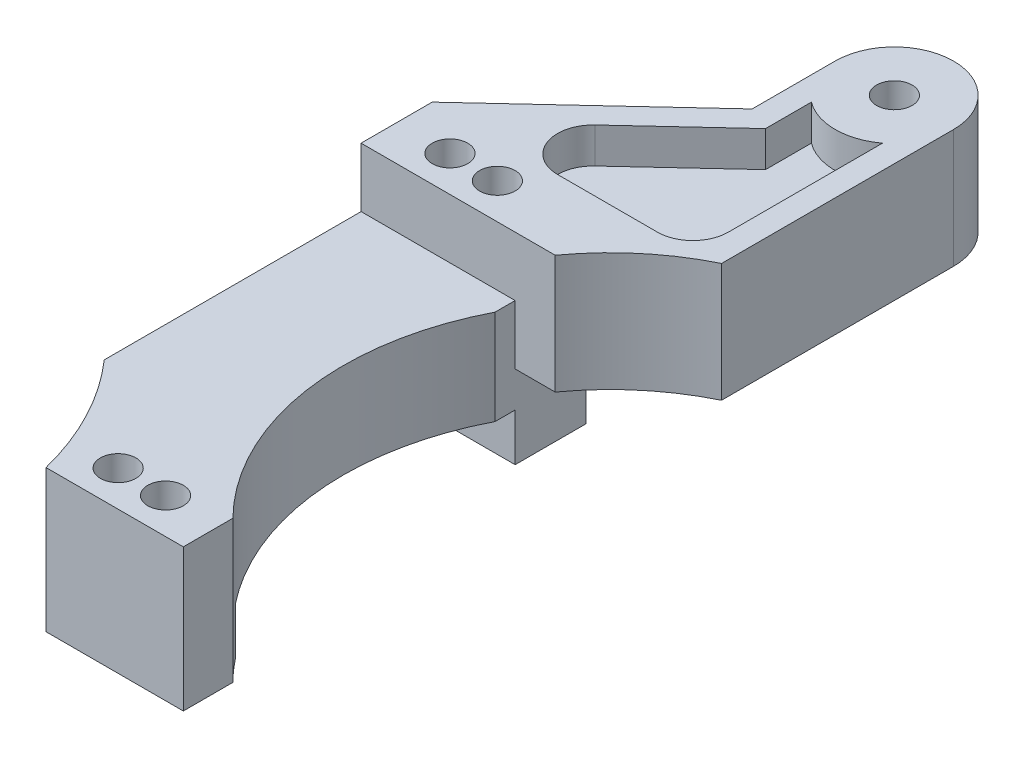
ISO-10303-21;
HEADER;
FILE_DESCRIPTION(('STEP AP214'),'2;1');
FILE_NAME('part.step','',(''),(''),'','','');
FILE_SCHEMA(('AUTOMOTIVE_DESIGN { 1 0 10303 214 1 1 1 1 }'));
ENDSEC;
DATA;
#1=APPLICATION_CONTEXT('core data for automotive mechanical design processes');
#2=APPLICATION_PROTOCOL_DEFINITION('international standard','automotive_design',2000,#1);
#3=PRODUCT_CONTEXT('',#1,'mechanical');
#4=PRODUCT('Part','Part','',(#3));
#5=PRODUCT_RELATED_PRODUCT_CATEGORY('part','',(#4));
#6=PRODUCT_DEFINITION_FORMATION('','',#4);
#7=PRODUCT_DEFINITION_CONTEXT('part definition',#1,'design');
#8=PRODUCT_DEFINITION('design','',#6,#7);
#9=PRODUCT_DEFINITION_SHAPE('','',#8);
#10=(LENGTH_UNIT() NAMED_UNIT(*) SI_UNIT(.MILLI.,.METRE.));
#11=(NAMED_UNIT(*) PLANE_ANGLE_UNIT() SI_UNIT($,.RADIAN.));
#12=(NAMED_UNIT(*) SI_UNIT($,.STERADIAN.) SOLID_ANGLE_UNIT());
#13=UNCERTAINTY_MEASURE_WITH_UNIT(LENGTH_MEASURE(1.E-05),#10,'distance_accuracy_value','');
#14=(GEOMETRIC_REPRESENTATION_CONTEXT(3) GLOBAL_UNCERTAINTY_ASSIGNED_CONTEXT((#13)) GLOBAL_UNIT_ASSIGNED_CONTEXT((#10,
#11,#12)) REPRESENTATION_CONTEXT('',''));
#15=CARTESIAN_POINT('',(0.,0.,0.));
#16=DIRECTION('',(0.,0.,1.));
#17=DIRECTION('',(1.,0.,0.));
#18=AXIS2_PLACEMENT_3D('',#15,#16,#17);
#19=CARTESIAN_POINT('',(0.,8.,0.));
#20=DIRECTION('',(0.,1.,0.));
#21=DIRECTION('',(0.,0.,1.));
#22=AXIS2_PLACEMENT_3D('',#19,#20,#21);
#23=PLANE('',#22);
#24=CARTESIAN_POINT('',(51.6000000000015,8.,-25.9999999999971));
#25=DIRECTION('',(0.,1.,0.));
#26=DIRECTION('',(0.,0.,1.));
#27=AXIS2_PLACEMENT_3D('',#24,#25,#26);
#28=CIRCLE('',#27,20.5);
#29=CARTESIAN_POINT('',(42.6000000000031,8.,-44.4187404563917));
#30=VERTEX_POINT('',#29);
#31=CARTESIAN_POINT('',(34.9792298614077,8.,-37.9999999999983));
#32=VERTEX_POINT('',#31);
#33=EDGE_CURVE('E307',#30,#32,#28,.T.);
#34=ORIENTED_EDGE('',*,*,#33,.F.);
#35=DIRECTION('',(0.,0.,-1.));
#36=VECTOR('',#35,1.);
#37=CARTESIAN_POINT('',(42.6000000000031,8.,0.));
#38=LINE('',#37,#36);
#39=CARTESIAN_POINT('',(42.6000000000031,8.,-63.9999999999983));
#40=VERTEX_POINT('',#39);
#41=EDGE_CURVE('E316',#30,#40,#38,.T.);
#42=ORIENTED_EDGE('',*,*,#41,.T.);
#43=CARTESIAN_POINT('',(37.6000000000031,8.,-63.9999999999983));
#44=DIRECTION('',(0.,1.,0.));
#45=DIRECTION('',(0.,0.,1.));
#46=AXIS2_PLACEMENT_3D('',#43,#44,#45);
#47=CIRCLE('',#46,5.);
#48=CARTESIAN_POINT('',(32.6000000000031,8.,-63.9999999999983));
#49=VERTEX_POINT('',#48);
#50=EDGE_CURVE('E325',#49,#40,#47,.F.);
#51=ORIENTED_EDGE('',*,*,#50,.F.);
#52=DIRECTION('',(0.,0.,-1.));
#53=VECTOR('',#52,1.);
#54=CARTESIAN_POINT('',(32.6000000000031,8.,0.));
#55=LINE('',#54,#53);
#56=CARTESIAN_POINT('',(32.6000000000031,8.,-56.9999999999982));
#57=VERTEX_POINT('',#56);
#58=EDGE_CURVE('E327',#57,#49,#55,.T.);
#59=ORIENTED_EDGE('',*,*,#58,.F.);
#60=DIRECTION('',(-0.732793491626299,0.,0.680451099367278));
#61=VECTOR('',#60,1.);
#62=CARTESIAN_POINT('',(-13.3276712328744,8.,-14.3528767123262));
#63=LINE('',#62,#61);
#64=CARTESIAN_POINT('',(18.6000000000031,8.,-43.9999999999983));
#65=VERTEX_POINT('',#64);
#66=EDGE_CURVE('E348',#57,#65,#63,.T.);
#67=ORIENTED_EDGE('',*,*,#66,.T.);
#68=DIRECTION('',(0.,0.,1.));
#69=VECTOR('',#68,1.);
#70=CARTESIAN_POINT('',(18.6000000000031,8.,0.));
#71=LINE('',#70,#69);
#72=CARTESIAN_POINT('',(18.6000000000031,8.,-37.9999999999983));
#73=VERTEX_POINT('',#72);
#74=EDGE_CURVE('E329',#65,#73,#71,.T.);
#75=ORIENTED_EDGE('',*,*,#74,.T.);
#76=DIRECTION('',(1.,0.,0.));
#77=VECTOR('',#76,1.);
#78=CARTESIAN_POINT('',(0.,8.,-37.9999999999983));
#79=LINE('',#78,#77);
#80=EDGE_CURVE('E319',#73,#32,#79,.T.);
#81=ORIENTED_EDGE('',*,*,#80,.T.);
#82=EDGE_LOOP('',(#34,#42,#51,#59,#67,#75,#81));
#83=FACE_BOUND('',#82,.T.);
#84=CARTESIAN_POINT('',(37.6000000000031,8.,-63.9999999999983));
#85=DIRECTION('',(0.,1.,0.));
#86=DIRECTION('',(0.,0.,1.));
#87=AXIS2_PLACEMENT_3D('',#84,#85,#86);
#88=CIRCLE('',#87,1.5);
#89=CARTESIAN_POINT('',(37.6000000000031,8.,-62.4999999999983));
#90=VERTEX_POINT('',#89);
#91=EDGE_CURVE('E335',#90,#90,#88,.F.);
#92=ORIENTED_EDGE('',*,*,#91,.T.);
#93=EDGE_LOOP('',(#92));
#94=FACE_BOUND('',#93,.T.);
#95=CARTESIAN_POINT('',(23.1000000000031,8.,-40.9999999999982));
#96=DIRECTION('',(0.,1.,0.));
#97=DIRECTION('',(0.,0.,1.));
#98=AXIS2_PLACEMENT_3D('',#95,#96,#97);
#99=CIRCLE('',#98,1.50000000000001);
#100=CARTESIAN_POINT('',(23.1000000000031,8.,-39.4999999999982));
#101=VERTEX_POINT('',#100);
#102=EDGE_CURVE('E338',#101,#101,#99,.F.);
#103=ORIENTED_EDGE('',*,*,#102,.T.);
#104=EDGE_LOOP('',(#103));
#105=FACE_BOUND('',#104,.T.);
#106=CARTESIAN_POINT('',(27.1000000000031,8.,-40.9999999999979));
#107=DIRECTION('',(0.,1.,0.));
#108=DIRECTION('',(0.,0.,1.));
#109=AXIS2_PLACEMENT_3D('',#106,#107,#108);
#110=CIRCLE('',#109,1.5);
#111=CARTESIAN_POINT('',(27.1000000000031,8.,-39.4999999999979));
#112=VERTEX_POINT('',#111);
#113=EDGE_CURVE('E341',#112,#112,#110,.F.);
#114=ORIENTED_EDGE('',*,*,#113,.T.);
#115=EDGE_LOOP('',(#114));
#116=FACE_BOUND('',#115,.T.);
#117=DIRECTION('',(0.,0.,1.));
#118=VECTOR('',#117,1.);
#119=CARTESIAN_POINT('',(34.6000000000032,8.,0.));
#120=LINE('',#119,#118);
#121=CARTESIAN_POINT('',(34.6000000000031,8.,-59.9999999999983));
#122=VERTEX_POINT('',#121);
#123=CARTESIAN_POINT('',(34.6000000000031,8.,-56.1278609750636));
#124=VERTEX_POINT('',#123);
#125=EDGE_CURVE('E521',#122,#124,#120,.T.);
#126=ORIENTED_EDGE('',*,*,#125,.F.);
#127=CARTESIAN_POINT('',(37.6000000000031,8.,-63.9999999999983));
#128=DIRECTION('',(0.,1.,0.));
#129=DIRECTION('',(0.,0.,1.));
#130=AXIS2_PLACEMENT_3D('',#127,#128,#129);
#131=CIRCLE('',#130,5.00000000000001);
#132=CARTESIAN_POINT('',(40.6000000000031,8.,-59.9999999999983));
#133=VERTEX_POINT('',#132);
#134=EDGE_CURVE('E519',#122,#133,#131,.T.);
#135=ORIENTED_EDGE('',*,*,#134,.T.);
#136=DIRECTION('',(0.,0.,-1.));
#137=VECTOR('',#136,1.);
#138=CARTESIAN_POINT('',(40.6000000000031,8.,0.));
#139=LINE('',#138,#137);
#140=CARTESIAN_POINT('',(40.6000000000031,8.,-46.9999999999983));
#141=VERTEX_POINT('',#140);
#142=EDGE_CURVE('E488',#141,#133,#139,.T.);
#143=ORIENTED_EDGE('',*,*,#142,.F.);
#144=CARTESIAN_POINT('',(37.6000000000031,8.,-46.9999999999983));
#145=DIRECTION('',(0.,1.,0.));
#146=DIRECTION('',(0.,0.,1.));
#147=AXIS2_PLACEMENT_3D('',#144,#145,#146);
#148=CIRCLE('',#147,3.);
#149=CARTESIAN_POINT('',(37.6000000000031,8.,-43.9999999999983));
#150=VERTEX_POINT('',#149);
#151=EDGE_CURVE('E139',#141,#150,#148,.F.);
#152=ORIENTED_EDGE('',*,*,#151,.T.);
#153=DIRECTION('',(1.,0.,0.));
#154=VECTOR('',#153,1.);
#155=CARTESIAN_POINT('',(0.,8.,-43.9999999999983));
#156=LINE('',#155,#154);
#157=CARTESIAN_POINT('',(29.1788358363657,8.,-43.9999999999983));
#158=VERTEX_POINT('',#157);
#159=EDGE_CURVE('E486',#158,#150,#156,.T.);
#160=ORIENTED_EDGE('',*,*,#159,.F.);
#161=CARTESIAN_POINT('',(29.1788358363657,8.,-46.9999999999983));
#162=DIRECTION('',(0.,1.,0.));
#163=DIRECTION('',(0.,0.,1.));
#164=AXIS2_PLACEMENT_3D('',#161,#162,#163);
#165=CIRCLE('',#164,3.);
#166=CARTESIAN_POINT('',(27.1374825382639,8.,-49.1983804748771));
#167=VERTEX_POINT('',#166);
#168=EDGE_CURVE('E480',#158,#167,#165,.F.);
#169=ORIENTED_EDGE('',*,*,#168,.T.);
#170=DIRECTION('',(-0.732793491626299,0.,0.680451099367278));
#171=VECTOR('',#170,1.);
#172=CARTESIAN_POINT('',(-11.9667690341398,8.,-12.8872897290736));
#173=LINE('',#172,#171);
#174=EDGE_CURVE('E494',#124,#167,#173,.T.);
#175=ORIENTED_EDGE('',*,*,#174,.F.);
#176=EDGE_LOOP('',(#126,#135,#143,#152,#160,#169,#175));
#177=FACE_BOUND('',#176,.T.);
#178=ADVANCED_FACE('F131',(#83,#94,#105,#116,#177),#23,.T.);
#179=CARTESIAN_POINT('',(0.,-5.,-43.9999999999983));
#180=DIRECTION('',(0.,0.,-1.));
#181=DIRECTION('',(0.,1.,0.));
#182=AXIS2_PLACEMENT_3D('',#179,#180,#181);
#183=PLANE('',#182);
#184=DIRECTION('',(0.,-1.,0.));
#185=VECTOR('',#184,1.);
#186=CARTESIAN_POINT('',(18.6000000000031,-5.,-43.9999999999983));
#187=LINE('',#186,#185);
#188=CARTESIAN_POINT('',(18.6000000000031,-2.,-43.9999999999983));
#189=VERTEX_POINT('',#188);
#190=CARTESIAN_POINT('',(18.6000000000031,-9.,-43.9999999999983));
#191=VERTEX_POINT('',#190);
#192=EDGE_CURVE('E461',#189,#191,#187,.T.);
#193=ORIENTED_EDGE('',*,*,#192,.F.);
#194=DIRECTION('',(-1.,0.,0.));
#195=VECTOR('',#194,1.);
#196=CARTESIAN_POINT('',(0.,-2.,-43.9999999999983));
#197=LINE('',#196,#195);
#198=CARTESIAN_POINT('',(31.6000000000031,-2.,-43.9999999999983));
#199=VERTEX_POINT('',#198);
#200=EDGE_CURVE('E539',#199,#189,#197,.T.);
#201=ORIENTED_EDGE('',*,*,#200,.F.);
#202=DIRECTION('',(0.,-1.,0.));
#203=VECTOR('',#202,1.);
#204=CARTESIAN_POINT('',(31.6000000000031,-5.,-43.9999999999983));
#205=LINE('',#204,#203);
#206=CARTESIAN_POINT('',(31.6000000000031,-9.,-43.9999999999983));
#207=VERTEX_POINT('',#206);
#208=EDGE_CURVE('E465',#199,#207,#205,.T.);
#209=ORIENTED_EDGE('',*,*,#208,.T.);
#210=DIRECTION('',(1.,0.,0.));
#211=VECTOR('',#210,1.);
#212=CARTESIAN_POINT('',(0.,-9.,-43.9999999999983));
#213=LINE('',#212,#211);
#214=EDGE_CURVE('E449',#191,#207,#213,.T.);
#215=ORIENTED_EDGE('',*,*,#214,.F.);
#216=EDGE_LOOP('',(#193,#201,#209,#215));
#217=FACE_BOUND('',#216,.T.);
#218=ADVANCED_FACE('F600',(#217),#183,.T.);
#219=CARTESIAN_POINT('',(31.6000000000031,-5.,0.));
#220=DIRECTION('',(1.,0.,0.));
#221=DIRECTION('',(0.,1.,0.));
#222=AXIS2_PLACEMENT_3D('',#219,#220,#221);
#223=PLANE('',#222);
#224=DIRECTION('',(0.,1.,0.));
#225=VECTOR('',#224,1.);
#226=CARTESIAN_POINT('',(31.6000000000031,-2.,-37.9999999999983));
#227=LINE('',#226,#225);
#228=CARTESIAN_POINT('',(31.6000000000031,-2.,-37.9999999999982));
#229=VERTEX_POINT('',#228);
#230=CARTESIAN_POINT('',(31.6000000000031,3.,-37.9999999999983));
#231=VERTEX_POINT('',#230);
#232=EDGE_CURVE('E349',#229,#231,#227,.T.);
#233=ORIENTED_EDGE('',*,*,#232,.T.);
#234=DIRECTION('',(0.,0.,-1.));
#235=VECTOR('',#234,1.);
#236=CARTESIAN_POINT('',(31.6000000000031,3.,0.));
#237=LINE('',#236,#235);
#238=CARTESIAN_POINT('',(31.6000000000031,3.,-36.3077640640445));
#239=VERTEX_POINT('',#238);
#240=EDGE_CURVE('E407',#239,#231,#237,.T.);
#241=ORIENTED_EDGE('',*,*,#240,.F.);
#242=DIRECTION('',(0.,-1.,0.));
#243=VECTOR('',#242,1.);
#244=CARTESIAN_POINT('',(31.6000000000031,3.,-36.3077640640445));
#245=LINE('',#244,#243);
#246=CARTESIAN_POINT('',(31.6000000000031,-5.,-36.3077640640445));
#247=VERTEX_POINT('',#246);
#248=EDGE_CURVE('E430',#239,#247,#245,.T.);
#249=ORIENTED_EDGE('',*,*,#248,.T.);
#250=DIRECTION('',(0.,0.,-1.));
#251=VECTOR('',#250,1.);
#252=CARTESIAN_POINT('',(31.6000000000031,-5.,0.));
#253=LINE('',#252,#251);
#254=CARTESIAN_POINT('',(31.6000000000031,-5.,-37.9999999999983));
#255=VERTEX_POINT('',#254);
#256=EDGE_CURVE('E420',#247,#255,#253,.T.);
#257=ORIENTED_EDGE('',*,*,#256,.T.);
#258=DIRECTION('',(0.,-1.,0.));
#259=VECTOR('',#258,1.);
#260=CARTESIAN_POINT('',(31.6000000000031,-5.,-37.9999999999983));
#261=LINE('',#260,#259);
#262=CARTESIAN_POINT('',(31.6000000000031,-9.,-37.9999999999983));
#263=VERTEX_POINT('',#262);
#264=EDGE_CURVE('E439',#255,#263,#261,.T.);
#265=ORIENTED_EDGE('',*,*,#264,.T.);
#266=DIRECTION('',(0.,0.,1.));
#267=VECTOR('',#266,1.);
#268=CARTESIAN_POINT('',(31.6000000000031,-9.,0.));
#269=LINE('',#268,#267);
#270=EDGE_CURVE('E446',#207,#263,#269,.T.);
#271=ORIENTED_EDGE('',*,*,#270,.F.);
#272=ORIENTED_EDGE('',*,*,#208,.F.);
#273=DIRECTION('',(0.,0.,-1.));
#274=VECTOR('',#273,1.);
#275=CARTESIAN_POINT('',(31.6000000000031,-2.,0.));
#276=LINE('',#275,#274);
#277=EDGE_CURVE('E542',#229,#199,#276,.T.);
#278=ORIENTED_EDGE('',*,*,#277,.F.);
#279=EDGE_LOOP('',(#233,#241,#249,#257,#265,#271,#272,#278));
#280=FACE_BOUND('',#279,.T.);
#281=ADVANCED_FACE('F607',(#280),#223,.T.);
#282=CARTESIAN_POINT('',(18.6000000000032,-5.,0.));
#283=DIRECTION('',(1.,0.,0.));
#284=DIRECTION('',(0.,0.,-1.));
#285=AXIS2_PLACEMENT_3D('',#282,#283,#284);
#286=PLANE('',#285);
#287=DIRECTION('',(0.,-1.,0.));
#288=VECTOR('',#287,1.);
#289=CARTESIAN_POINT('',(18.6000000000031,-5.,-37.9999999999983));
#290=LINE('',#289,#288);
#291=CARTESIAN_POINT('',(18.6000000000031,-5.,-37.9999999999983));
#292=VERTEX_POINT('',#291);
#293=CARTESIAN_POINT('',(18.6000000000031,-9.,-37.9999999999983));
#294=VERTEX_POINT('',#293);
#295=EDGE_CURVE('E458',#292,#294,#290,.T.);
#296=ORIENTED_EDGE('',*,*,#295,.F.);
#297=DIRECTION('',(0.,0.,-1.));
#298=VECTOR('',#297,1.);
#299=CARTESIAN_POINT('',(18.6000000000031,-5.,0.));
#300=LINE('',#299,#298);
#301=CARTESIAN_POINT('',(18.6000000000031,-5.,-16.3279668054502));
#302=VERTEX_POINT('',#301);
#303=EDGE_CURVE('E418',#302,#292,#300,.T.);
#304=ORIENTED_EDGE('',*,*,#303,.F.);
#305=DIRECTION('',(0.,-1.,0.));
#306=VECTOR('',#305,1.);
#307=CARTESIAN_POINT('',(18.6000000000031,3.,-16.3279668054502));
#308=LINE('',#307,#306);
#309=CARTESIAN_POINT('',(18.6000000000031,3.,-16.3279668054502));
#310=VERTEX_POINT('',#309);
#311=EDGE_CURVE('E432',#310,#302,#308,.T.);
#312=ORIENTED_EDGE('',*,*,#311,.F.);
#313=DIRECTION('',(0.,0.,-1.));
#314=VECTOR('',#313,1.);
#315=CARTESIAN_POINT('',(18.6000000000031,3.,0.));
#316=LINE('',#315,#314);
#317=CARTESIAN_POINT('',(18.6000000000031,3.,-37.9999999999982));
#318=VERTEX_POINT('',#317);
#319=EDGE_CURVE('E405',#310,#318,#316,.T.);
#320=ORIENTED_EDGE('',*,*,#319,.T.);
#321=DIRECTION('',(0.,-1.,0.));
#322=VECTOR('',#321,1.);
#323=CARTESIAN_POINT('',(18.6000000000031,8.,-37.9999999999983));
#324=LINE('',#323,#322);
#325=EDGE_CURVE('E354',#73,#318,#324,.T.);
#326=ORIENTED_EDGE('',*,*,#325,.F.);
#327=ORIENTED_EDGE('',*,*,#74,.F.);
#328=EDGE_CURVE('E462',#65,#189,#187,.T.);
#329=ORIENTED_EDGE('',*,*,#328,.T.);
#330=ORIENTED_EDGE('',*,*,#192,.T.);
#331=DIRECTION('',(0.,0.,1.));
#332=VECTOR('',#331,1.);
#333=CARTESIAN_POINT('',(18.6000000000032,-9.,0.));
#334=LINE('',#333,#332);
#335=EDGE_CURVE('E452',#191,#294,#334,.T.);
#336=ORIENTED_EDGE('',*,*,#335,.T.);
#337=EDGE_LOOP('',(#296,#304,#312,#320,#326,#327,#329,#330,#336));
#338=FACE_BOUND('',#337,.T.);
#339=ADVANCED_FACE('F561',(#338),#286,.F.);
#340=CARTESIAN_POINT('',(23.1000000000031,-5.,-40.9999999999982));
#341=DIRECTION('',(0.,-1.,0.));
#342=DIRECTION('',(0.,0.,-1.));
#343=AXIS2_PLACEMENT_3D('',#340,#341,#342);
#344=CYLINDRICAL_SURFACE('',#343,1.50000000000001);
#345=CARTESIAN_POINT('',(23.1000000000031,-9.,-40.9999999999982));
#346=DIRECTION('',(0.,1.,0.));
#347=DIRECTION('',(0.,0.,1.));
#348=AXIS2_PLACEMENT_3D('',#345,#346,#347);
#349=CIRCLE('',#348,1.50000000000001);
#350=CARTESIAN_POINT('',(23.1000000000031,-9.,-39.4999999999982));
#351=VERTEX_POINT('',#350);
#352=EDGE_CURVE('E443',#351,#351,#349,.T.);
#353=ORIENTED_EDGE('',*,*,#352,.F.);
#354=EDGE_LOOP('',(#353));
#355=FACE_BOUND('',#354,.T.);
#356=ORIENTED_EDGE('',*,*,#102,.F.);
#357=EDGE_LOOP('',(#356));
#358=FACE_BOUND('',#357,.T.);
#359=ADVANCED_FACE('F683',(#355,#358),#344,.F.);
#360=CARTESIAN_POINT('',(27.1000000000031,-5.,-40.9999999999979));
#361=DIRECTION('',(0.,-1.,0.));
#362=DIRECTION('',(0.,0.,-1.));
#363=AXIS2_PLACEMENT_3D('',#360,#361,#362);
#364=CYLINDRICAL_SURFACE('',#363,1.5);
#365=CARTESIAN_POINT('',(27.1000000000031,-9.,-40.9999999999979));
#366=DIRECTION('',(0.,1.,0.));
#367=DIRECTION('',(0.,0.,1.));
#368=AXIS2_PLACEMENT_3D('',#365,#366,#367);
#369=CIRCLE('',#368,1.5);
#370=CARTESIAN_POINT('',(27.1000000000031,-9.,-39.4999999999979));
#371=VERTEX_POINT('',#370);
#372=EDGE_CURVE('E427',#371,#371,#369,.T.);
#373=ORIENTED_EDGE('',*,*,#372,.F.);
#374=EDGE_LOOP('',(#373));
#375=FACE_BOUND('',#374,.T.);
#376=ORIENTED_EDGE('',*,*,#113,.F.);
#377=EDGE_LOOP('',(#376));
#378=FACE_BOUND('',#377,.T.);
#379=ADVANCED_FACE('F681',(#375,#378),#364,.F.);
#380=CARTESIAN_POINT('',(0.,-5.,-37.9999999999983));
#381=DIRECTION('',(0.,0.,-1.));
#382=DIRECTION('',(0.,1.,0.));
#383=AXIS2_PLACEMENT_3D('',#380,#381,#382);
#384=PLANE('',#383);
#385=DIRECTION('',(1.,0.,0.));
#386=VECTOR('',#385,1.);
#387=CARTESIAN_POINT('',(0.,-9.,-37.9999999999983));
#388=LINE('',#387,#386);
#389=EDGE_CURVE('E440',#294,#263,#388,.T.);
#390=ORIENTED_EDGE('',*,*,#389,.T.);
#391=ORIENTED_EDGE('',*,*,#264,.F.);
#392=DIRECTION('',(1.,0.,0.));
#393=VECTOR('',#392,1.);
#394=CARTESIAN_POINT('',(0.,-5.,-37.9999999999983));
#395=LINE('',#394,#393);
#396=EDGE_CURVE('E436',#292,#255,#395,.T.);
#397=ORIENTED_EDGE('',*,*,#396,.F.);
#398=ORIENTED_EDGE('',*,*,#295,.T.);
#399=EDGE_LOOP('',(#390,#391,#397,#398));
#400=FACE_BOUND('',#399,.T.);
#401=ADVANCED_FACE('F677',(#400),#384,.F.);
#402=CARTESIAN_POINT('',(0.,-9.,0.));
#403=DIRECTION('',(0.,1.,0.));
#404=DIRECTION('',(0.,0.,1.));
#405=AXIS2_PLACEMENT_3D('',#402,#403,#404);
#406=PLANE('',#405);
#407=ORIENTED_EDGE('',*,*,#372,.T.);
#408=EDGE_LOOP('',(#407));
#409=FACE_BOUND('',#408,.T.);
#410=ORIENTED_EDGE('',*,*,#352,.T.);
#411=EDGE_LOOP('',(#410));
#412=FACE_BOUND('',#411,.T.);
#413=ORIENTED_EDGE('',*,*,#270,.T.);
#414=ORIENTED_EDGE('',*,*,#389,.F.);
#415=ORIENTED_EDGE('',*,*,#335,.F.);
#416=ORIENTED_EDGE('',*,*,#214,.T.);
#417=EDGE_LOOP('',(#413,#414,#415,#416));
#418=FACE_BOUND('',#417,.T.);
#419=ADVANCED_FACE('F659',(#409,#412,#418),#406,.F.);
#420=CARTESIAN_POINT('',(0.,-5.,0.));
#421=DIRECTION('',(0.,1.,0.));
#422=DIRECTION('',(0.,0.,1.));
#423=AXIS2_PLACEMENT_3D('',#420,#421,#422);
#424=PLANE('',#423);
#425=CARTESIAN_POINT('',(51.6000000000015,-5.,-25.9999999999971));
#426=DIRECTION('',(0.,1.,0.));
#427=DIRECTION('',(0.,0.,1.));
#428=AXIS2_PLACEMENT_3D('',#425,#426,#427);
#429=CIRCLE('',#428,22.5);
#430=CARTESIAN_POINT('',(33.9860850461922,-5.,-11.9999999999979));
#431=VERTEX_POINT('',#430);
#432=EDGE_CURVE('E402',#247,#431,#429,.T.);
#433=ORIENTED_EDGE('',*,*,#432,.T.);
#434=DIRECTION('',(1.,0.,0.));
#435=VECTOR('',#434,1.);
#436=CARTESIAN_POINT('',(0.,-5.,-11.9999999999979));
#437=LINE('',#436,#435);
#438=CARTESIAN_POINT('',(22.6000000000007,-5.,-11.9999999999979));
#439=VERTEX_POINT('',#438);
#440=EDGE_CURVE('E358',#439,#431,#437,.T.);
#441=ORIENTED_EDGE('',*,*,#440,.F.);
#442=DIRECTION('',(0.,0.,-1.));
#443=VECTOR('',#442,1.);
#444=CARTESIAN_POINT('',(22.6000000000007,-5.,0.));
#445=LINE('',#444,#443);
#446=CARTESIAN_POINT('',(22.6000000000007,-5.,-10.0897224937046));
#447=VERTEX_POINT('',#446);
#448=EDGE_CURVE('E361',#447,#439,#445,.T.);
#449=ORIENTED_EDGE('',*,*,#448,.F.);
#450=CARTESIAN_POINT('',(0.,-5.,0.));
#451=DIRECTION('',(0.,1.,0.));
#452=DIRECTION('',(0.,0.,1.));
#453=AXIS2_PLACEMENT_3D('',#450,#451,#452);
#454=CIRCLE('',#453,24.75);
#455=EDGE_CURVE('E398',#447,#302,#454,.T.);
#456=ORIENTED_EDGE('',*,*,#455,.T.);
#457=ORIENTED_EDGE('',*,*,#303,.T.);
#458=ORIENTED_EDGE('',*,*,#396,.T.);
#459=ORIENTED_EDGE('',*,*,#256,.F.);
#460=EDGE_LOOP('',(#433,#441,#449,#456,#457,#458,#459));
#461=FACE_BOUND('',#460,.T.);
#462=ADVANCED_FACE('F655',(#461),#424,.F.);
#463=CARTESIAN_POINT('',(0.,3.,0.));
#464=DIRECTION('',(0.,1.,0.));
#465=DIRECTION('',(0.,0.,1.));
#466=AXIS2_PLACEMENT_3D('',#463,#464,#465);
#467=PLANE('',#466);
#468=DIRECTION('',(1.,0.,0.));
#469=VECTOR('',#468,1.);
#470=CARTESIAN_POINT('',(0.,3.,-37.9999999999983));
#471=LINE('',#470,#469);
#472=EDGE_CURVE('E345',#318,#231,#471,.T.);
#473=ORIENTED_EDGE('',*,*,#472,.F.);
#474=ORIENTED_EDGE('',*,*,#319,.F.);
#475=CARTESIAN_POINT('',(0.,3.,0.));
#476=DIRECTION('',(0.,1.,0.));
#477=DIRECTION('',(0.,0.,1.));
#478=AXIS2_PLACEMENT_3D('',#475,#476,#477);
#479=CIRCLE('',#478,24.75);
#480=CARTESIAN_POINT('',(24.0117158903737,3.,-5.99999999999794));
#481=VERTEX_POINT('',#480);
#482=EDGE_CURVE('E401',#481,#310,#479,.T.);
#483=ORIENTED_EDGE('',*,*,#482,.F.);
#484=DIRECTION('',(-1.,0.,0.));
#485=VECTOR('',#484,1.);
#486=CARTESIAN_POINT('',(0.,3.,-5.99999999999793));
#487=LINE('',#486,#485);
#488=CARTESIAN_POINT('',(35.6000000000007,3.,-5.99999999999794));
#489=VERTEX_POINT('',#488);
#490=EDGE_CURVE('E399',#489,#481,#487,.T.);
#491=ORIENTED_EDGE('',*,*,#490,.F.);
#492=DIRECTION('',(0.,0.,1.));
#493=VECTOR('',#492,1.);
#494=CARTESIAN_POINT('',(35.6000000000007,3.,0.));
#495=LINE('',#494,#493);
#496=CARTESIAN_POINT('',(35.6000000000007,3.,-10.1807079804415));
#497=VERTEX_POINT('',#496);
#498=EDGE_CURVE('E413',#497,#489,#495,.T.);
#499=ORIENTED_EDGE('',*,*,#498,.F.);
#500=CARTESIAN_POINT('',(51.6000000000015,3.,-25.9999999999971));
#501=DIRECTION('',(0.,1.,0.));
#502=DIRECTION('',(0.,0.,1.));
#503=AXIS2_PLACEMENT_3D('',#500,#501,#502);
#504=CIRCLE('',#503,22.5);
#505=EDGE_CURVE('E410',#239,#497,#504,.T.);
#506=ORIENTED_EDGE('',*,*,#505,.F.);
#507=ORIENTED_EDGE('',*,*,#240,.T.);
#508=EDGE_LOOP('',(#473,#474,#483,#491,#499,#506,#507));
#509=FACE_BOUND('',#508,.T.);
#510=CARTESIAN_POINT('',(27.1000000000007,3.,-8.99999999999794));
#511=DIRECTION('',(0.,1.,0.));
#512=DIRECTION('',(0.,0.,1.));
#513=AXIS2_PLACEMENT_3D('',#510,#511,#512);
#514=CIRCLE('',#513,1.5);
#515=CARTESIAN_POINT('',(27.1000000000007,3.,-7.49999999999793));
#516=VERTEX_POINT('',#515);
#517=EDGE_CURVE('E392',#516,#516,#514,.T.);
#518=ORIENTED_EDGE('',*,*,#517,.F.);
#519=EDGE_LOOP('',(#518));
#520=FACE_BOUND('',#519,.T.);
#521=CARTESIAN_POINT('',(31.1000000000007,3.,-8.99999999999764));
#522=DIRECTION('',(0.,1.,0.));
#523=DIRECTION('',(0.,0.,1.));
#524=AXIS2_PLACEMENT_3D('',#521,#522,#523);
#525=CIRCLE('',#524,1.5);
#526=CARTESIAN_POINT('',(31.1000000000007,3.,-7.49999999999763));
#527=VERTEX_POINT('',#526);
#528=EDGE_CURVE('E395',#527,#527,#525,.T.);
#529=ORIENTED_EDGE('',*,*,#528,.F.);
#530=EDGE_LOOP('',(#529));
#531=FACE_BOUND('',#530,.T.);
#532=ADVANCED_FACE('F651',(#509,#520,#531),#467,.T.);
#533=CARTESIAN_POINT('',(0.,3.,-5.99999999999793));
#534=DIRECTION('',(0.,0.,1.));
#535=DIRECTION('',(1.,0.,0.));
#536=AXIS2_PLACEMENT_3D('',#533,#534,#535);
#537=PLANE('',#536);
#538=ORIENTED_EDGE('',*,*,#490,.T.);
#539=DIRECTION('',(0.,-1.,0.));
#540=VECTOR('',#539,1.);
#541=CARTESIAN_POINT('',(24.0117158903737,3.,-5.99999999999794));
#542=LINE('',#541,#540);
#543=CARTESIAN_POINT('',(24.0117158903737,-9.,-5.99999999999794));
#544=VERTEX_POINT('',#543);
#545=EDGE_CURVE('E416',#481,#544,#542,.T.);
#546=ORIENTED_EDGE('',*,*,#545,.T.);
#547=DIRECTION('',(1.,0.,0.));
#548=VECTOR('',#547,1.);
#549=CARTESIAN_POINT('',(0.,-9.,-5.99999999999793));
#550=LINE('',#549,#548);
#551=CARTESIAN_POINT('',(35.6000000000007,-9.,-5.99999999999794));
#552=VERTEX_POINT('',#551);
#553=EDGE_CURVE('E368',#544,#552,#550,.T.);
#554=ORIENTED_EDGE('',*,*,#553,.T.);
#555=DIRECTION('',(0.,-1.,0.));
#556=VECTOR('',#555,1.);
#557=CARTESIAN_POINT('',(35.6000000000007,3.,-5.99999999999794));
#558=LINE('',#557,#556);
#559=EDGE_CURVE('E424',#489,#552,#558,.T.);
#560=ORIENTED_EDGE('',*,*,#559,.F.);
#561=EDGE_LOOP('',(#538,#546,#554,#560));
#562=FACE_BOUND('',#561,.T.);
#563=ADVANCED_FACE('F654',(#562),#537,.T.);
#564=CARTESIAN_POINT('',(35.6000000000007,3.,0.));
#565=DIRECTION('',(1.,0.,0.));
#566=DIRECTION('',(0.,1.,0.));
#567=AXIS2_PLACEMENT_3D('',#564,#565,#566);
#568=PLANE('',#567);
#569=ORIENTED_EDGE('',*,*,#559,.T.);
#570=DIRECTION('',(0.,0.,-1.));
#571=VECTOR('',#570,1.);
#572=CARTESIAN_POINT('',(35.6000000000007,-9.,0.));
#573=LINE('',#572,#571);
#574=CARTESIAN_POINT('',(35.6000000000007,-9.,-10.1807079804415));
#575=VERTEX_POINT('',#574);
#576=EDGE_CURVE('E370',#552,#575,#573,.T.);
#577=ORIENTED_EDGE('',*,*,#576,.T.);
#578=DIRECTION('',(0.,-1.,0.));
#579=VECTOR('',#578,1.);
#580=CARTESIAN_POINT('',(35.6000000000007,3.,-10.1807079804415));
#581=LINE('',#580,#579);
#582=EDGE_CURVE('E428',#497,#575,#581,.T.);
#583=ORIENTED_EDGE('',*,*,#582,.F.);
#584=ORIENTED_EDGE('',*,*,#498,.T.);
#585=EDGE_LOOP('',(#569,#577,#583,#584));
#586=FACE_BOUND('',#585,.T.);
#587=ADVANCED_FACE('F661',(#586),#568,.T.);
#588=CARTESIAN_POINT('',(51.6000000000015,3.,-25.9999999999971));
#589=DIRECTION('',(0.,-1.,0.));
#590=DIRECTION('',(0.,0.,-1.));
#591=AXIS2_PLACEMENT_3D('',#588,#589,#590);
#592=CYLINDRICAL_SURFACE('',#591,22.5);
#593=ORIENTED_EDGE('',*,*,#432,.F.);
#594=ORIENTED_EDGE('',*,*,#248,.F.);
#595=ORIENTED_EDGE('',*,*,#505,.T.);
#596=ORIENTED_EDGE('',*,*,#582,.T.);
#597=CARTESIAN_POINT('',(51.6000000000015,-9.,-25.9999999999971));
#598=DIRECTION('',(0.,1.,0.));
#599=DIRECTION('',(0.,0.,1.));
#600=AXIS2_PLACEMENT_3D('',#597,#598,#599);
#601=CIRCLE('',#600,22.5);
#602=CARTESIAN_POINT('',(33.9860850461922,-9.,-11.9999999999979));
#603=VERTEX_POINT('',#602);
#604=EDGE_CURVE('E373',#603,#575,#601,.T.);
#605=ORIENTED_EDGE('',*,*,#604,.F.);
#606=DIRECTION('',(0.,-1.,0.));
#607=VECTOR('',#606,1.);
#608=CARTESIAN_POINT('',(33.9860850461922,-5.,-11.9999999999979));
#609=LINE('',#608,#607);
#610=EDGE_CURVE('E390',#431,#603,#609,.T.);
#611=ORIENTED_EDGE('',*,*,#610,.F.);
#612=EDGE_LOOP('',(#593,#594,#595,#596,#605,#611));
#613=FACE_BOUND('',#612,.T.);
#614=ADVANCED_FACE('F664',(#613),#592,.F.);
#615=CARTESIAN_POINT('',(0.,3.,0.));
#616=DIRECTION('',(0.,-1.,0.));
#617=DIRECTION('',(0.,0.,-1.));
#618=AXIS2_PLACEMENT_3D('',#615,#616,#617);
#619=CYLINDRICAL_SURFACE('',#618,24.75);
#620=ORIENTED_EDGE('',*,*,#455,.F.);
#621=DIRECTION('',(0.,-1.,0.));
#622=VECTOR('',#621,1.);
#623=CARTESIAN_POINT('',(22.6000000000007,-5.,-10.0897224937046));
#624=LINE('',#623,#622);
#625=CARTESIAN_POINT('',(22.6000000000007,-9.,-10.0897224937046));
#626=VERTEX_POINT('',#625);
#627=EDGE_CURVE('E365',#447,#626,#624,.T.);
#628=ORIENTED_EDGE('',*,*,#627,.T.);
#629=CARTESIAN_POINT('',(0.,-9.,0.));
#630=DIRECTION('',(0.,1.,0.));
#631=DIRECTION('',(0.,0.,1.));
#632=AXIS2_PLACEMENT_3D('',#629,#630,#631);
#633=CIRCLE('',#632,24.75);
#634=EDGE_CURVE('E357',#544,#626,#633,.T.);
#635=ORIENTED_EDGE('',*,*,#634,.F.);
#636=ORIENTED_EDGE('',*,*,#545,.F.);
#637=ORIENTED_EDGE('',*,*,#482,.T.);
#638=ORIENTED_EDGE('',*,*,#311,.T.);
#639=EDGE_LOOP('',(#620,#628,#635,#636,#637,#638));
#640=FACE_BOUND('',#639,.T.);
#641=ADVANCED_FACE('F649',(#640),#619,.F.);
#642=CARTESIAN_POINT('',(31.1000000000007,3.,-8.99999999999764));
#643=DIRECTION('',(0.,-1.,0.));
#644=DIRECTION('',(0.,0.,-1.));
#645=AXIS2_PLACEMENT_3D('',#642,#643,#644);
#646=CYLINDRICAL_SURFACE('',#645,1.5);
#647=ORIENTED_EDGE('',*,*,#528,.T.);
#648=EDGE_LOOP('',(#647));
#649=FACE_BOUND('',#648,.T.);
#650=CARTESIAN_POINT('',(31.1000000000007,-9.,-8.99999999999764));
#651=DIRECTION('',(0.,1.,0.));
#652=DIRECTION('',(0.,0.,1.));
#653=AXIS2_PLACEMENT_3D('',#650,#651,#652);
#654=CIRCLE('',#653,1.5);
#655=CARTESIAN_POINT('',(31.1000000000007,-9.,-7.49999999999763));
#656=VERTEX_POINT('',#655);
#657=EDGE_CURVE('E362',#656,#656,#654,.T.);
#658=ORIENTED_EDGE('',*,*,#657,.F.);
#659=EDGE_LOOP('',(#658));
#660=FACE_BOUND('',#659,.T.);
#661=ADVANCED_FACE('F645',(#649,#660),#646,.F.);
#662=CARTESIAN_POINT('',(27.1000000000007,3.,-8.99999999999794));
#663=DIRECTION('',(0.,-1.,0.));
#664=DIRECTION('',(0.,0.,-1.));
#665=AXIS2_PLACEMENT_3D('',#662,#663,#664);
#666=CYLINDRICAL_SURFACE('',#665,1.5);
#667=ORIENTED_EDGE('',*,*,#517,.T.);
#668=EDGE_LOOP('',(#667));
#669=FACE_BOUND('',#668,.T.);
#670=CARTESIAN_POINT('',(27.1000000000007,-9.,-8.99999999999794));
#671=DIRECTION('',(0.,1.,0.));
#672=DIRECTION('',(0.,0.,1.));
#673=AXIS2_PLACEMENT_3D('',#670,#671,#672);
#674=CIRCLE('',#673,1.5);
#675=CARTESIAN_POINT('',(27.1000000000007,-9.,-7.49999999999793));
#676=VERTEX_POINT('',#675);
#677=EDGE_CURVE('E382',#676,#676,#674,.T.);
#678=ORIENTED_EDGE('',*,*,#677,.F.);
#679=EDGE_LOOP('',(#678));
#680=FACE_BOUND('',#679,.T.);
#681=ADVANCED_FACE('F641',(#669,#680),#666,.F.);
#682=CARTESIAN_POINT('',(0.,-5.,-11.9999999999979));
#683=DIRECTION('',(0.,0.,-1.));
#684=DIRECTION('',(0.,1.,0.));
#685=AXIS2_PLACEMENT_3D('',#682,#683,#684);
#686=PLANE('',#685);
#687=DIRECTION('',(1.,0.,0.));
#688=VECTOR('',#687,1.);
#689=CARTESIAN_POINT('',(0.,-9.,-11.9999999999979));
#690=LINE('',#689,#688);
#691=CARTESIAN_POINT('',(22.6000000000007,-9.,-11.9999999999979));
#692=VERTEX_POINT('',#691);
#693=EDGE_CURVE('E376',#692,#603,#690,.T.);
#694=ORIENTED_EDGE('',*,*,#693,.F.);
#695=DIRECTION('',(0.,-1.,0.));
#696=VECTOR('',#695,1.);
#697=CARTESIAN_POINT('',(22.6000000000007,-5.,-11.9999999999979));
#698=LINE('',#697,#696);
#699=EDGE_CURVE('E388',#439,#692,#698,.T.);
#700=ORIENTED_EDGE('',*,*,#699,.F.);
#701=ORIENTED_EDGE('',*,*,#440,.T.);
#702=ORIENTED_EDGE('',*,*,#610,.T.);
#703=EDGE_LOOP('',(#694,#700,#701,#702));
#704=FACE_BOUND('',#703,.T.);
#705=ADVANCED_FACE('F637',(#704),#686,.T.);
#706=CARTESIAN_POINT('',(22.6000000000007,-5.,0.));
#707=DIRECTION('',(-1.,0.,0.));
#708=DIRECTION('',(0.,-1.,0.));
#709=AXIS2_PLACEMENT_3D('',#706,#707,#708);
#710=PLANE('',#709);
#711=DIRECTION('',(0.,0.,-1.));
#712=VECTOR('',#711,1.);
#713=CARTESIAN_POINT('',(22.6000000000007,-9.,0.));
#714=LINE('',#713,#712);
#715=EDGE_CURVE('E379',#626,#692,#714,.T.);
#716=ORIENTED_EDGE('',*,*,#715,.F.);
#717=ORIENTED_EDGE('',*,*,#627,.F.);
#718=ORIENTED_EDGE('',*,*,#448,.T.);
#719=ORIENTED_EDGE('',*,*,#699,.T.);
#720=EDGE_LOOP('',(#716,#717,#718,#719));
#721=FACE_BOUND('',#720,.T.);
#722=ADVANCED_FACE('F633',(#721),#710,.T.);
#723=CARTESIAN_POINT('',(0.,-9.,0.));
#724=DIRECTION('',(0.,1.,0.));
#725=DIRECTION('',(0.,0.,1.));
#726=AXIS2_PLACEMENT_3D('',#723,#724,#725);
#727=PLANE('',#726);
#728=ORIENTED_EDGE('',*,*,#634,.T.);
#729=ORIENTED_EDGE('',*,*,#715,.T.);
#730=ORIENTED_EDGE('',*,*,#693,.T.);
#731=ORIENTED_EDGE('',*,*,#604,.T.);
#732=ORIENTED_EDGE('',*,*,#576,.F.);
#733=ORIENTED_EDGE('',*,*,#553,.F.);
#734=EDGE_LOOP('',(#728,#729,#730,#731,#732,#733));
#735=FACE_BOUND('',#734,.T.);
#736=ORIENTED_EDGE('',*,*,#677,.T.);
#737=EDGE_LOOP('',(#736));
#738=FACE_BOUND('',#737,.T.);
#739=ORIENTED_EDGE('',*,*,#657,.T.);
#740=EDGE_LOOP('',(#739));
#741=FACE_BOUND('',#740,.T.);
#742=ADVANCED_FACE('F629',(#735,#738,#741),#727,.F.);
#743=CARTESIAN_POINT('',(-13.3276712328744,8.,-14.3528767123262));
#744=DIRECTION('',(0.680451099367278,0.,0.732793491626299));
#745=DIRECTION('',(0.732793491626299,0.,-0.680451099367278));
#746=AXIS2_PLACEMENT_3D('',#743,#744,#745);
#747=PLANE('',#746);
#748=DIRECTION('',(0.,-1.,0.));
#749=VECTOR('',#748,1.);
#750=CARTESIAN_POINT('',(32.6000000000031,8.,-56.9999999999982));
#751=LINE('',#750,#749);
#752=CARTESIAN_POINT('',(32.6000000000031,-2.,-56.9999999999982));
#753=VERTEX_POINT('',#752);
#754=EDGE_CURVE('E344',#57,#753,#751,.T.);
#755=ORIENTED_EDGE('',*,*,#754,.T.);
#756=DIRECTION('',(-0.732793491626299,0.,0.680451099367278));
#757=VECTOR('',#756,1.);
#758=CARTESIAN_POINT('',(-13.3276712328744,-2.,-14.3528767123262));
#759=LINE('',#758,#757);
#760=EDGE_CURVE('E536',#753,#189,#759,.T.);
#761=ORIENTED_EDGE('',*,*,#760,.T.);
#762=ORIENTED_EDGE('',*,*,#328,.F.);
#763=ORIENTED_EDGE('',*,*,#66,.F.);
#764=EDGE_LOOP('',(#755,#761,#762,#763));
#765=FACE_BOUND('',#764,.T.);
#766=ADVANCED_FACE('F626',(#765),#747,.F.);
#767=CARTESIAN_POINT('',(0.,8.,-37.9999999999983));
#768=DIRECTION('',(0.,0.,-1.));
#769=DIRECTION('',(-1.,0.,0.));
#770=AXIS2_PLACEMENT_3D('',#767,#768,#769);
#771=PLANE('',#770);
#772=DIRECTION('',(1.,0.,0.));
#773=VECTOR('',#772,1.);
#774=CARTESIAN_POINT('',(0.,-2.,-37.9999999999983));
#775=LINE('',#774,#773);
#776=CARTESIAN_POINT('',(34.9792298614077,-2.,-37.9999999999983));
#777=VERTEX_POINT('',#776);
#778=EDGE_CURVE('E545',#229,#777,#775,.T.);
#779=ORIENTED_EDGE('',*,*,#778,.T.);
#780=DIRECTION('',(0.,1.,0.));
#781=VECTOR('',#780,1.);
#782=CARTESIAN_POINT('',(34.9792298614077,-9.,-37.9999999999983));
#783=LINE('',#782,#781);
#784=EDGE_CURVE('E146',#777,#32,#783,.T.);
#785=ORIENTED_EDGE('',*,*,#784,.T.);
#786=ORIENTED_EDGE('',*,*,#80,.F.);
#787=ORIENTED_EDGE('',*,*,#325,.T.);
#788=ORIENTED_EDGE('',*,*,#472,.T.);
#789=ORIENTED_EDGE('',*,*,#232,.F.);
#790=EDGE_LOOP('',(#779,#785,#786,#787,#788,#789));
#791=FACE_BOUND('',#790,.T.);
#792=ADVANCED_FACE('F565',(#791),#771,.F.);
#793=CARTESIAN_POINT('',(42.6000000000031,8.,0.));
#794=DIRECTION('',(-1.,0.,0.));
#795=DIRECTION('',(0.,0.,1.));
#796=AXIS2_PLACEMENT_3D('',#793,#794,#795);
#797=PLANE('',#796);
#798=ORIENTED_EDGE('',*,*,#41,.F.);
#799=DIRECTION('',(0.,1.,0.));
#800=VECTOR('',#799,1.);
#801=CARTESIAN_POINT('',(42.6000000000031,-9.,-44.4187404563917));
#802=LINE('',#801,#800);
#803=CARTESIAN_POINT('',(42.6000000000031,-2.,-44.4187404563917));
#804=VERTEX_POINT('',#803);
#805=EDGE_CURVE('E304',#30,#804,#802,.F.);
#806=ORIENTED_EDGE('',*,*,#805,.T.);
#807=DIRECTION('',(0.,0.,-1.));
#808=VECTOR('',#807,1.);
#809=CARTESIAN_POINT('',(42.6000000000031,-2.,0.));
#810=LINE('',#809,#808);
#811=CARTESIAN_POINT('',(42.6000000000031,-2.,-63.9999999999983));
#812=VERTEX_POINT('',#811);
#813=EDGE_CURVE('E548',#804,#812,#810,.T.);
#814=ORIENTED_EDGE('',*,*,#813,.T.);
#815=DIRECTION('',(0.,-1.,0.));
#816=VECTOR('',#815,1.);
#817=CARTESIAN_POINT('',(42.6000000000031,8.,-63.9999999999983));
#818=LINE('',#817,#816);
#819=EDGE_CURVE('E323',#40,#812,#818,.T.);
#820=ORIENTED_EDGE('',*,*,#819,.F.);
#821=EDGE_LOOP('',(#798,#806,#814,#820));
#822=FACE_BOUND('',#821,.T.);
#823=ADVANCED_FACE('F321',(#822),#797,.F.);
#824=CARTESIAN_POINT('',(37.6000000000031,8.,-63.9999999999983));
#825=DIRECTION('',(0.,-1.,0.));
#826=DIRECTION('',(0.,0.,-1.));
#827=AXIS2_PLACEMENT_3D('',#824,#825,#826);
#828=CYLINDRICAL_SURFACE('',#827,5.);
#829=ORIENTED_EDGE('',*,*,#819,.T.);
#830=CARTESIAN_POINT('',(37.6000000000031,-2.,-63.9999999999983));
#831=DIRECTION('',(0.,1.,0.));
#832=DIRECTION('',(0.,0.,1.));
#833=AXIS2_PLACEMENT_3D('',#830,#831,#832);
#834=CIRCLE('',#833,5.);
#835=CARTESIAN_POINT('',(32.6000000000031,-2.,-63.9999999999983));
#836=VERTEX_POINT('',#835);
#837=EDGE_CURVE('E529',#836,#812,#834,.F.);
#838=ORIENTED_EDGE('',*,*,#837,.F.);
#839=DIRECTION('',(0.,-1.,0.));
#840=VECTOR('',#839,1.);
#841=CARTESIAN_POINT('',(32.6000000000031,8.,-63.9999999999983));
#842=LINE('',#841,#840);
#843=EDGE_CURVE('E351',#49,#836,#842,.T.);
#844=ORIENTED_EDGE('',*,*,#843,.F.);
#845=ORIENTED_EDGE('',*,*,#50,.T.);
#846=EDGE_LOOP('',(#829,#838,#844,#845));
#847=FACE_BOUND('',#846,.T.);
#848=ADVANCED_FACE('F614',(#847),#828,.T.);
#849=CARTESIAN_POINT('',(37.6000000000031,8.,-63.9999999999983));
#850=DIRECTION('',(0.,-1.,0.));
#851=DIRECTION('',(0.,0.,-1.));
#852=AXIS2_PLACEMENT_3D('',#849,#850,#851);
#853=CYLINDRICAL_SURFACE('',#852,1.5);
#854=ORIENTED_EDGE('',*,*,#91,.F.);
#855=EDGE_LOOP('',(#854));
#856=FACE_BOUND('',#855,.T.);
#857=CARTESIAN_POINT('',(37.6000000000031,-2.,-63.9999999999983));
#858=DIRECTION('',(0.,1.,0.));
#859=DIRECTION('',(0.,0.,1.));
#860=AXIS2_PLACEMENT_3D('',#857,#858,#859);
#861=CIRCLE('',#860,1.5);
#862=CARTESIAN_POINT('',(37.6000000000031,-2.,-62.4999999999983));
#863=VERTEX_POINT('',#862);
#864=EDGE_CURVE('E550',#863,#863,#861,.F.);
#865=ORIENTED_EDGE('',*,*,#864,.T.);
#866=EDGE_LOOP('',(#865));
#867=FACE_BOUND('',#866,.T.);
#868=ADVANCED_FACE('F611',(#856,#867),#853,.F.);
#869=CARTESIAN_POINT('',(32.6000000000031,8.,0.));
#870=DIRECTION('',(-1.,0.,0.));
#871=DIRECTION('',(0.,0.,1.));
#872=AXIS2_PLACEMENT_3D('',#869,#870,#871);
#873=PLANE('',#872);
#874=ORIENTED_EDGE('',*,*,#843,.T.);
#875=DIRECTION('',(0.,0.,-1.));
#876=VECTOR('',#875,1.);
#877=CARTESIAN_POINT('',(32.6000000000031,-2.,0.));
#878=LINE('',#877,#876);
#879=EDGE_CURVE('E533',#753,#836,#878,.T.);
#880=ORIENTED_EDGE('',*,*,#879,.F.);
#881=ORIENTED_EDGE('',*,*,#754,.F.);
#882=ORIENTED_EDGE('',*,*,#58,.T.);
#883=EDGE_LOOP('',(#874,#880,#881,#882));
#884=FACE_BOUND('',#883,.T.);
#885=ADVANCED_FACE('F595',(#884),#873,.T.);
#886=CARTESIAN_POINT('',(0.,-2.,0.));
#887=DIRECTION('',(0.,1.,0.));
#888=DIRECTION('',(0.,0.,1.));
#889=AXIS2_PLACEMENT_3D('',#886,#887,#888);
#890=PLANE('',#889);
#891=ORIENTED_EDGE('',*,*,#813,.F.);
#892=CARTESIAN_POINT('',(51.6000000000015,-2.,-25.9999999999971));
#893=DIRECTION('',(0.,1.,0.));
#894=DIRECTION('',(0.,0.,1.));
#895=AXIS2_PLACEMENT_3D('',#892,#893,#894);
#896=CIRCLE('',#895,20.5);
#897=EDGE_CURVE('E12',#804,#777,#896,.T.);
#898=ORIENTED_EDGE('',*,*,#897,.T.);
#899=ORIENTED_EDGE('',*,*,#778,.F.);
#900=ORIENTED_EDGE('',*,*,#277,.T.);
#901=ORIENTED_EDGE('',*,*,#200,.T.);
#902=ORIENTED_EDGE('',*,*,#760,.F.);
#903=ORIENTED_EDGE('',*,*,#879,.T.);
#904=ORIENTED_EDGE('',*,*,#837,.T.);
#905=EDGE_LOOP('',(#891,#898,#899,#900,#901,#902,#903,#904));
#906=FACE_BOUND('',#905,.T.);
#907=ORIENTED_EDGE('',*,*,#864,.F.);
#908=EDGE_LOOP('',(#907));
#909=FACE_BOUND('',#908,.T.);
#910=ADVANCED_FACE('F587',(#906,#909),#890,.F.);
#911=CARTESIAN_POINT('',(37.6000000000031,5.,-63.9999999999983));
#912=DIRECTION('',(0.,1.,0.));
#913=DIRECTION('',(0.,0.,1.));
#914=AXIS2_PLACEMENT_3D('',#911,#912,#913);
#915=CYLINDRICAL_SURFACE('',#914,5.00000000000001);
#916=ORIENTED_EDGE('',*,*,#134,.F.);
#917=DIRECTION('',(0.,1.,0.));
#918=VECTOR('',#917,1.);
#919=CARTESIAN_POINT('',(34.6000000000031,5.,-59.9999999999983));
#920=LINE('',#919,#918);
#921=CARTESIAN_POINT('',(34.6000000000031,5.,-59.9999999999983));
#922=VERTEX_POINT('',#921);
#923=EDGE_CURVE('E510',#922,#122,#920,.T.);
#924=ORIENTED_EDGE('',*,*,#923,.F.);
#925=CARTESIAN_POINT('',(37.6000000000031,5.,-63.9999999999983));
#926=DIRECTION('',(0.,1.,0.));
#927=DIRECTION('',(0.,0.,1.));
#928=AXIS2_PLACEMENT_3D('',#925,#926,#927);
#929=CIRCLE('',#928,5.00000000000001);
#930=CARTESIAN_POINT('',(40.6000000000031,5.,-59.9999999999983));
#931=VERTEX_POINT('',#930);
#932=EDGE_CURVE('E527',#922,#931,#929,.T.);
#933=ORIENTED_EDGE('',*,*,#932,.T.);
#934=DIRECTION('',(0.,1.,0.));
#935=VECTOR('',#934,1.);
#936=CARTESIAN_POINT('',(40.6000000000031,5.,-59.9999999999983));
#937=LINE('',#936,#935);
#938=EDGE_CURVE('E509',#931,#133,#937,.T.);
#939=ORIENTED_EDGE('',*,*,#938,.T.);
#940=EDGE_LOOP('',(#916,#924,#933,#939));
#941=FACE_BOUND('',#940,.T.);
#942=ADVANCED_FACE('F585',(#941),#915,.T.);
#943=CARTESIAN_POINT('',(40.6000000000031,5.,0.));
#944=DIRECTION('',(1.,0.,0.));
#945=DIRECTION('',(0.,0.,-1.));
#946=AXIS2_PLACEMENT_3D('',#943,#944,#945);
#947=PLANE('',#946);
#948=DIRECTION('',(0.,0.,-1.));
#949=VECTOR('',#948,1.);
#950=CARTESIAN_POINT('',(40.6000000000031,5.,0.));
#951=LINE('',#950,#949);
#952=CARTESIAN_POINT('',(40.6000000000031,5.,-46.9999999999983));
#953=VERTEX_POINT('',#952);
#954=EDGE_CURVE('E502',#953,#931,#951,.T.);
#955=ORIENTED_EDGE('',*,*,#954,.F.);
#956=DIRECTION('',(0.,1.,0.));
#957=VECTOR('',#956,1.);
#958=CARTESIAN_POINT('',(40.6000000000031,8.,-46.9999999999983));
#959=LINE('',#958,#957);
#960=EDGE_CURVE('E478',#953,#141,#959,.T.);
#961=ORIENTED_EDGE('',*,*,#960,.T.);
#962=ORIENTED_EDGE('',*,*,#142,.T.);
#963=ORIENTED_EDGE('',*,*,#938,.F.);
#964=EDGE_LOOP('',(#955,#961,#962,#963));
#965=FACE_BOUND('',#964,.T.);
#966=ADVANCED_FACE('F507',(#965),#947,.F.);
#967=CARTESIAN_POINT('',(0.,5.,-43.9999999999983));
#968=DIRECTION('',(0.,0.,1.));
#969=DIRECTION('',(1.,0.,0.));
#970=AXIS2_PLACEMENT_3D('',#967,#968,#969);
#971=PLANE('',#970);
#972=DIRECTION('',(1.,0.,0.));
#973=VECTOR('',#972,1.);
#974=CARTESIAN_POINT('',(0.,5.,-43.9999999999983));
#975=LINE('',#974,#973);
#976=CARTESIAN_POINT('',(29.1788358363657,5.,-43.9999999999983));
#977=VERTEX_POINT('',#976);
#978=CARTESIAN_POINT('',(37.6000000000031,5.,-43.9999999999983));
#979=VERTEX_POINT('',#978);
#980=EDGE_CURVE('E504',#977,#979,#975,.T.);
#981=ORIENTED_EDGE('',*,*,#980,.F.);
#982=DIRECTION('',(0.,1.,0.));
#983=VECTOR('',#982,1.);
#984=CARTESIAN_POINT('',(29.1788358363657,8.,-43.9999999999983));
#985=LINE('',#984,#983);
#986=EDGE_CURVE('E469',#977,#158,#985,.T.);
#987=ORIENTED_EDGE('',*,*,#986,.T.);
#988=ORIENTED_EDGE('',*,*,#159,.T.);
#989=DIRECTION('',(0.,1.,0.));
#990=VECTOR('',#989,1.);
#991=CARTESIAN_POINT('',(37.6000000000031,5.,-43.9999999999983));
#992=LINE('',#991,#990);
#993=EDGE_CURVE('E467',#150,#979,#992,.F.);
#994=ORIENTED_EDGE('',*,*,#993,.T.);
#995=EDGE_LOOP('',(#981,#987,#988,#994));
#996=FACE_BOUND('',#995,.T.);
#997=ADVANCED_FACE('F491',(#996),#971,.F.);
#998=CARTESIAN_POINT('',(-11.9667690341398,5.,-12.8872897290736));
#999=DIRECTION('',(-0.680451099367278,0.,-0.732793491626299));
#1000=DIRECTION('',(-0.732793491626299,0.,0.680451099367278));
#1001=AXIS2_PLACEMENT_3D('',#998,#999,#1000);
#1002=PLANE('',#1001);
#1003=ORIENTED_EDGE('',*,*,#174,.T.);
#1004=DIRECTION('',(0.,1.,0.));
#1005=VECTOR('',#1004,1.);
#1006=CARTESIAN_POINT('',(27.1374825382639,5.,-49.1983804748772));
#1007=LINE('',#1006,#1005);
#1008=CARTESIAN_POINT('',(27.1374825382639,5.,-49.1983804748771));
#1009=VERTEX_POINT('',#1008);
#1010=EDGE_CURVE('E472',#167,#1009,#1007,.F.);
#1011=ORIENTED_EDGE('',*,*,#1010,.T.);
#1012=DIRECTION('',(-0.732793491626299,0.,0.680451099367278));
#1013=VECTOR('',#1012,1.);
#1014=CARTESIAN_POINT('',(-11.9667690341398,5.,-12.8872897290736));
#1015=LINE('',#1014,#1013);
#1016=CARTESIAN_POINT('',(34.6000000000031,5.,-56.1278609750636));
#1017=VERTEX_POINT('',#1016);
#1018=EDGE_CURVE('E515',#1017,#1009,#1015,.T.);
#1019=ORIENTED_EDGE('',*,*,#1018,.F.);
#1020=DIRECTION('',(0.,1.,0.));
#1021=VECTOR('',#1020,1.);
#1022=CARTESIAN_POINT('',(34.6000000000031,5.,-56.1278609750636));
#1023=LINE('',#1022,#1021);
#1024=EDGE_CURVE('E513',#1017,#124,#1023,.T.);
#1025=ORIENTED_EDGE('',*,*,#1024,.T.);
#1026=EDGE_LOOP('',(#1003,#1011,#1019,#1025));
#1027=FACE_BOUND('',#1026,.T.);
#1028=ADVANCED_FACE('F581',(#1027),#1002,.F.);
#1029=CARTESIAN_POINT('',(34.6000000000032,5.,0.));
#1030=DIRECTION('',(-1.,0.,0.));
#1031=DIRECTION('',(0.,0.,1.));
#1032=AXIS2_PLACEMENT_3D('',#1029,#1030,#1031);
#1033=PLANE('',#1032);
#1034=ORIENTED_EDGE('',*,*,#125,.T.);
#1035=ORIENTED_EDGE('',*,*,#1024,.F.);
#1036=DIRECTION('',(0.,0.,1.));
#1037=VECTOR('',#1036,1.);
#1038=CARTESIAN_POINT('',(34.6000000000032,5.,0.));
#1039=LINE('',#1038,#1037);
#1040=EDGE_CURVE('E571',#922,#1017,#1039,.T.);
#1041=ORIENTED_EDGE('',*,*,#1040,.F.);
#1042=ORIENTED_EDGE('',*,*,#923,.T.);
#1043=EDGE_LOOP('',(#1034,#1035,#1041,#1042));
#1044=FACE_BOUND('',#1043,.T.);
#1045=ADVANCED_FACE('F583',(#1044),#1033,.F.);
#1046=CARTESIAN_POINT('',(0.,5.,0.));
#1047=DIRECTION('',(0.,1.,0.));
#1048=DIRECTION('',(0.,0.,1.));
#1049=AXIS2_PLACEMENT_3D('',#1046,#1047,#1048);
#1050=PLANE('',#1049);
#1051=ORIENTED_EDGE('',*,*,#1018,.T.);
#1052=CARTESIAN_POINT('',(29.1788358363657,5.,-46.9999999999983));
#1053=DIRECTION('',(0.,1.,0.));
#1054=DIRECTION('',(0.,0.,1.));
#1055=AXIS2_PLACEMENT_3D('',#1052,#1053,#1054);
#1056=CIRCLE('',#1055,3.);
#1057=EDGE_CURVE('E476',#1009,#977,#1056,.T.);
#1058=ORIENTED_EDGE('',*,*,#1057,.T.);
#1059=ORIENTED_EDGE('',*,*,#980,.T.);
#1060=CARTESIAN_POINT('',(37.6000000000031,5.,-46.9999999999983));
#1061=DIRECTION('',(0.,1.,0.));
#1062=DIRECTION('',(0.,0.,1.));
#1063=AXIS2_PLACEMENT_3D('',#1060,#1061,#1062);
#1064=CIRCLE('',#1063,3.);
#1065=EDGE_CURVE('E474',#979,#953,#1064,.T.);
#1066=ORIENTED_EDGE('',*,*,#1065,.T.);
#1067=ORIENTED_EDGE('',*,*,#954,.T.);
#1068=ORIENTED_EDGE('',*,*,#932,.F.);
#1069=ORIENTED_EDGE('',*,*,#1040,.T.);
#1070=EDGE_LOOP('',(#1051,#1058,#1059,#1066,#1067,#1068,#1069));
#1071=FACE_BOUND('',#1070,.T.);
#1072=ADVANCED_FACE('F500',(#1071),#1050,.T.);
#1073=CARTESIAN_POINT('',(29.1788358363657,5.,-46.9999999999983));
#1074=DIRECTION('',(0.,-1.,0.));
#1075=DIRECTION('',(0.,0.,-1.));
#1076=AXIS2_PLACEMENT_3D('',#1073,#1074,#1075);
#1077=CYLINDRICAL_SURFACE('',#1076,3.);
#1078=ORIENTED_EDGE('',*,*,#1057,.F.);
#1079=ORIENTED_EDGE('',*,*,#1010,.F.);
#1080=ORIENTED_EDGE('',*,*,#168,.F.);
#1081=ORIENTED_EDGE('',*,*,#986,.F.);
#1082=EDGE_LOOP('',(#1078,#1079,#1080,#1081));
#1083=FACE_BOUND('',#1082,.T.);
#1084=ADVANCED_FACE('F579',(#1083),#1077,.F.);
#1085=CARTESIAN_POINT('',(37.6000000000031,5.,-46.9999999999983));
#1086=DIRECTION('',(0.,-1.,0.));
#1087=DIRECTION('',(0.,0.,-1.));
#1088=AXIS2_PLACEMENT_3D('',#1085,#1086,#1087);
#1089=CYLINDRICAL_SURFACE('',#1088,3.);
#1090=ORIENTED_EDGE('',*,*,#1065,.F.);
#1091=ORIENTED_EDGE('',*,*,#993,.F.);
#1092=ORIENTED_EDGE('',*,*,#151,.F.);
#1093=ORIENTED_EDGE('',*,*,#960,.F.);
#1094=EDGE_LOOP('',(#1090,#1091,#1092,#1093));
#1095=FACE_BOUND('',#1094,.T.);
#1096=ADVANCED_FACE('F133',(#1095),#1089,.F.);
#1097=CARTESIAN_POINT('',(51.6000000000015,-9.,-25.9999999999971));
#1098=DIRECTION('',(0.,1.,0.));
#1099=DIRECTION('',(0.,0.,1.));
#1100=AXIS2_PLACEMENT_3D('',#1097,#1098,#1099);
#1101=CYLINDRICAL_SURFACE('',#1100,20.5);
#1102=ORIENTED_EDGE('',*,*,#897,.F.);
#1103=ORIENTED_EDGE('',*,*,#805,.F.);
#1104=ORIENTED_EDGE('',*,*,#33,.T.);
#1105=ORIENTED_EDGE('',*,*,#784,.F.);
#1106=EDGE_LOOP('',(#1102,#1103,#1104,#1105));
#1107=FACE_BOUND('',#1106,.T.);
#1108=ADVANCED_FACE('F306',(#1107),#1101,.F.);
#1109=CLOSED_SHELL('',(#178,#218,#281,#339,#359,#379,#401,#419,#462,#532,#563,#587,#614,#641,
#661,#681,#705,#722,#742,#766,#792,#823,#848,#868,#885,#910,#942,#966,#997,#1028,#1045,#1072,
#1084,#1096,#1108));
#1110=MANIFOLD_SOLID_BREP('B2',#1109);
#1111=ADVANCED_BREP_SHAPE_REPRESENTATION('',(#18,#1110),#14);
#1112=SHAPE_DEFINITION_REPRESENTATION(#9,#1111);
ENDSEC;
END-ISO-10303-21;
